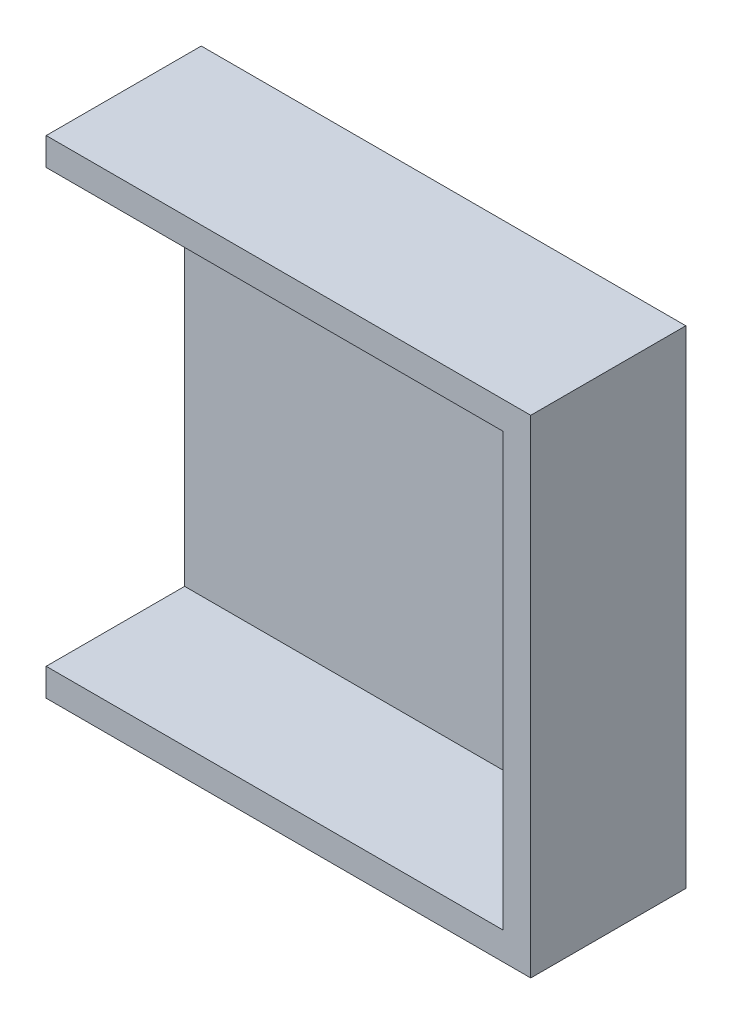
ISO-10303-21;
HEADER;
FILE_DESCRIPTION(('STEP AP214'),'2;1');
FILE_NAME('part.step','',(''),(''),'','','');
FILE_SCHEMA(('AUTOMOTIVE_DESIGN { 1 0 10303 214 1 1 1 1 }'));
ENDSEC;
DATA;
#1=APPLICATION_CONTEXT('core data for automotive mechanical design processes');
#2=APPLICATION_PROTOCOL_DEFINITION('international standard','automotive_design',2000,#1);
#3=PRODUCT_CONTEXT('',#1,'mechanical');
#4=PRODUCT('Part','Part','',(#3));
#5=PRODUCT_RELATED_PRODUCT_CATEGORY('part','',(#4));
#6=PRODUCT_DEFINITION_FORMATION('','',#4);
#7=PRODUCT_DEFINITION_CONTEXT('part definition',#1,'design');
#8=PRODUCT_DEFINITION('design','',#6,#7);
#9=PRODUCT_DEFINITION_SHAPE('','',#8);
#10=(LENGTH_UNIT() NAMED_UNIT(*) SI_UNIT(.MILLI.,.METRE.));
#11=(NAMED_UNIT(*) PLANE_ANGLE_UNIT() SI_UNIT($,.RADIAN.));
#12=(NAMED_UNIT(*) SI_UNIT($,.STERADIAN.) SOLID_ANGLE_UNIT());
#13=UNCERTAINTY_MEASURE_WITH_UNIT(LENGTH_MEASURE(1.E-05),#10,'distance_accuracy_value','');
#14=(GEOMETRIC_REPRESENTATION_CONTEXT(3) GLOBAL_UNCERTAINTY_ASSIGNED_CONTEXT((#13)) GLOBAL_UNIT_ASSIGNED_CONTEXT((#10,
#11,#12)) REPRESENTATION_CONTEXT('',''));
#15=CARTESIAN_POINT('',(0.,0.,0.));
#16=DIRECTION('',(0.,0.,1.));
#17=DIRECTION('',(1.,0.,0.));
#18=AXIS2_PLACEMENT_3D('',#15,#16,#17);
#19=CARTESIAN_POINT('',(-63.5908396946565,16.5526717557252,1.2));
#20=DIRECTION('',(1.,0.,0.));
#21=DIRECTION('',(0.,0.,-1.));
#22=AXIS2_PLACEMENT_3D('',#19,#20,#21);
#23=PLANE('',#22);
#24=DIRECTION('',(0.,-1.,0.));
#25=VECTOR('',#24,1.);
#26=CARTESIAN_POINT('',(-63.5908396946565,16.5526717557252,0.));
#27=LINE('',#26,#25);
#28=CARTESIAN_POINT('',(-63.5908396946565,16.5526717557252,0.));
#29=VERTEX_POINT('',#28);
#30=CARTESIAN_POINT('',(-63.5908396946565,-18.6473282442748,0.));
#31=VERTEX_POINT('',#30);
#32=EDGE_CURVE('E160',#29,#31,#27,.T.);
#33=ORIENTED_EDGE('',*,*,#32,.T.);
#34=DIRECTION('',(0.,0.,-1.));
#35=VECTOR('',#34,1.);
#36=CARTESIAN_POINT('',(-63.5908396946565,-18.6473282442748,1.2));
#37=LINE('',#36,#35);
#38=CARTESIAN_POINT('',(-63.5908396946565,-18.6473282442748,11.2));
#39=VERTEX_POINT('',#38);
#40=EDGE_CURVE('E11',#39,#31,#37,.T.);
#41=ORIENTED_EDGE('',*,*,#40,.F.);
#42=DIRECTION('',(0.,-1.,0.));
#43=VECTOR('',#42,1.);
#44=CARTESIAN_POINT('',(-63.5908396946565,-16.6473282442748,11.2));
#45=LINE('',#44,#43);
#46=CARTESIAN_POINT('',(-63.5908396946565,-16.6473282442748,11.2));
#47=VERTEX_POINT('',#46);
#48=EDGE_CURVE('E132',#47,#39,#45,.T.);
#49=ORIENTED_EDGE('',*,*,#48,.F.);
#50=DIRECTION('',(0.,0.,-1.));
#51=VECTOR('',#50,1.);
#52=CARTESIAN_POINT('',(-63.5908396946565,-16.6473282442748,11.2));
#53=LINE('',#52,#51);
#54=CARTESIAN_POINT('',(-63.5908396946565,-16.6473282442748,1.2));
#55=VERTEX_POINT('',#54);
#56=EDGE_CURVE('E138',#47,#55,#53,.T.);
#57=ORIENTED_EDGE('',*,*,#56,.T.);
#58=DIRECTION('',(0.,-1.,0.));
#59=VECTOR('',#58,1.);
#60=CARTESIAN_POINT('',(-63.5908396946565,16.5526717557252,1.2));
#61=LINE('',#60,#59);
#62=CARTESIAN_POINT('',(-63.5908396946565,14.5526717557252,1.2));
#63=VERTEX_POINT('',#62);
#64=EDGE_CURVE('E54',#63,#55,#61,.T.);
#65=ORIENTED_EDGE('',*,*,#64,.F.);
#66=DIRECTION('',(0.,0.,-1.));
#67=VECTOR('',#66,1.);
#68=CARTESIAN_POINT('',(-63.5908396946565,14.5526717557252,11.2));
#69=LINE('',#68,#67);
#70=CARTESIAN_POINT('',(-63.5908396946565,14.5526717557252,11.2));
#71=VERTEX_POINT('',#70);
#72=EDGE_CURVE('E113',#71,#63,#69,.T.);
#73=ORIENTED_EDGE('',*,*,#72,.F.);
#74=DIRECTION('',(0.,-1.,0.));
#75=VECTOR('',#74,1.);
#76=CARTESIAN_POINT('',(-63.5908396946565,16.5526717557252,11.2));
#77=LINE('',#76,#75);
#78=CARTESIAN_POINT('',(-63.5908396946565,16.5526717557252,11.2));
#79=VERTEX_POINT('',#78);
#80=EDGE_CURVE('E111',#79,#71,#77,.T.);
#81=ORIENTED_EDGE('',*,*,#80,.F.);
#82=DIRECTION('',(0.,0.,-1.));
#83=VECTOR('',#82,1.);
#84=CARTESIAN_POINT('',(-63.5908396946565,16.5526717557252,1.2));
#85=LINE('',#84,#83);
#86=EDGE_CURVE('E97',#79,#29,#85,.T.);
#87=ORIENTED_EDGE('',*,*,#86,.T.);
#88=EDGE_LOOP('',(#33,#41,#49,#57,#65,#73,#81,#87));
#89=FACE_BOUND('',#88,.T.);
#90=ADVANCED_FACE('F33',(#89),#23,.F.);
#91=CARTESIAN_POINT('',(-63.5908396946565,-18.6473282442748,1.2));
#92=DIRECTION('',(0.,1.,0.));
#93=DIRECTION('',(0.,0.,1.));
#94=AXIS2_PLACEMENT_3D('',#91,#92,#93);
#95=PLANE('',#94);
#96=DIRECTION('',(1.,0.,0.));
#97=VECTOR('',#96,1.);
#98=CARTESIAN_POINT('',(-63.5908396946565,-18.6473282442748,0.));
#99=LINE('',#98,#97);
#100=CARTESIAN_POINT('',(-28.5908396946565,-18.6473282442748,0.));
#101=VERTEX_POINT('',#100);
#102=EDGE_CURVE('E180',#31,#101,#99,.T.);
#103=ORIENTED_EDGE('',*,*,#102,.T.);
#104=DIRECTION('',(0.,0.,-1.));
#105=VECTOR('',#104,1.);
#106=CARTESIAN_POINT('',(-28.5908396946565,-18.6473282442748,1.2));
#107=LINE('',#106,#105);
#108=CARTESIAN_POINT('',(-28.5908396946565,-18.6473282442748,11.2));
#109=VERTEX_POINT('',#108);
#110=EDGE_CURVE('E41',#109,#101,#107,.T.);
#111=ORIENTED_EDGE('',*,*,#110,.F.);
#112=DIRECTION('',(1.,0.,0.));
#113=VECTOR('',#112,1.);
#114=CARTESIAN_POINT('',(-63.5908396946565,-18.6473282442748,11.2));
#115=LINE('',#114,#113);
#116=EDGE_CURVE('E135',#39,#109,#115,.T.);
#117=ORIENTED_EDGE('',*,*,#116,.F.);
#118=ORIENTED_EDGE('',*,*,#40,.T.);
#119=EDGE_LOOP('',(#103,#111,#117,#118));
#120=FACE_BOUND('',#119,.T.);
#121=ADVANCED_FACE('F178',(#120),#95,.F.);
#122=CARTESIAN_POINT('',(-28.5908396946565,16.5526717557252,1.2));
#123=DIRECTION('',(-1.,0.,0.));
#124=DIRECTION('',(0.,-1.,0.));
#125=AXIS2_PLACEMENT_3D('',#122,#123,#124);
#126=PLANE('',#125);
#127=DIRECTION('',(0.,1.,0.));
#128=VECTOR('',#127,1.);
#129=CARTESIAN_POINT('',(-28.5908396946565,16.5526717557252,0.));
#130=LINE('',#129,#128);
#131=CARTESIAN_POINT('',(-28.5908396946565,16.5526717557252,0.));
#132=VERTEX_POINT('',#131);
#133=EDGE_CURVE('E186',#101,#132,#130,.T.);
#134=ORIENTED_EDGE('',*,*,#133,.T.);
#135=DIRECTION('',(0.,0.,-1.));
#136=VECTOR('',#135,1.);
#137=CARTESIAN_POINT('',(-28.5908396946565,16.5526717557252,1.2));
#138=LINE('',#137,#136);
#139=CARTESIAN_POINT('',(-28.5908396946565,16.5526717557252,11.2));
#140=VERTEX_POINT('',#139);
#141=EDGE_CURVE('E108',#140,#132,#138,.T.);
#142=ORIENTED_EDGE('',*,*,#141,.F.);
#143=DIRECTION('',(0.,1.,0.));
#144=VECTOR('',#143,1.);
#145=CARTESIAN_POINT('',(-28.5908396946565,-18.6473282442748,11.2));
#146=LINE('',#145,#144);
#147=EDGE_CURVE('E122',#109,#140,#146,.T.);
#148=ORIENTED_EDGE('',*,*,#147,.F.);
#149=ORIENTED_EDGE('',*,*,#110,.T.);
#150=EDGE_LOOP('',(#134,#142,#148,#149));
#151=FACE_BOUND('',#150,.T.);
#152=ADVANCED_FACE('F189',(#151),#126,.F.);
#153=CARTESIAN_POINT('',(-63.5908396946565,16.5526717557252,1.2));
#154=DIRECTION('',(0.,-1.,0.));
#155=DIRECTION('',(0.,0.,-1.));
#156=AXIS2_PLACEMENT_3D('',#153,#154,#155);
#157=PLANE('',#156);
#158=DIRECTION('',(-1.,0.,0.));
#159=VECTOR('',#158,1.);
#160=CARTESIAN_POINT('',(-63.5908396946565,16.5526717557252,0.));
#161=LINE('',#160,#159);
#162=EDGE_CURVE('E104',#132,#29,#161,.T.);
#163=ORIENTED_EDGE('',*,*,#162,.T.);
#164=ORIENTED_EDGE('',*,*,#86,.F.);
#165=DIRECTION('',(-1.,0.,0.));
#166=VECTOR('',#165,1.);
#167=CARTESIAN_POINT('',(-28.5908396946565,16.5526717557252,11.2));
#168=LINE('',#167,#166);
#169=EDGE_CURVE('E102',#140,#79,#168,.T.);
#170=ORIENTED_EDGE('',*,*,#169,.F.);
#171=ORIENTED_EDGE('',*,*,#141,.T.);
#172=EDGE_LOOP('',(#163,#164,#170,#171));
#173=FACE_BOUND('',#172,.T.);
#174=ADVANCED_FACE('F99',(#173),#157,.F.);
#175=CARTESIAN_POINT('',(0.,0.,1.2));
#176=DIRECTION('',(0.,0.,1.));
#177=DIRECTION('',(1.,0.,0.));
#178=AXIS2_PLACEMENT_3D('',#175,#176,#177);
#179=PLANE('',#178);
#180=DIRECTION('',(-1.,0.,0.));
#181=VECTOR('',#180,1.);
#182=CARTESIAN_POINT('',(-30.5908396946565,-16.6473282442748,1.2));
#183=LINE('',#182,#181);
#184=CARTESIAN_POINT('',(-30.5908396946565,-16.6473282442748,1.2));
#185=VERTEX_POINT('',#184);
#186=EDGE_CURVE('E49',#185,#55,#183,.T.);
#187=ORIENTED_EDGE('',*,*,#186,.F.);
#188=DIRECTION('',(0.,-1.,0.));
#189=VECTOR('',#188,1.);
#190=CARTESIAN_POINT('',(-30.5908396946565,14.5526717557252,1.2));
#191=LINE('',#190,#189);
#192=CARTESIAN_POINT('',(-30.5908396946565,14.5526717557252,1.2));
#193=VERTEX_POINT('',#192);
#194=EDGE_CURVE('E124',#193,#185,#191,.T.);
#195=ORIENTED_EDGE('',*,*,#194,.F.);
#196=DIRECTION('',(1.,0.,0.));
#197=VECTOR('',#196,1.);
#198=CARTESIAN_POINT('',(-63.5908396946565,14.5526717557252,1.2));
#199=LINE('',#198,#197);
#200=EDGE_CURVE('E140',#63,#193,#199,.T.);
#201=ORIENTED_EDGE('',*,*,#200,.F.);
#202=ORIENTED_EDGE('',*,*,#64,.T.);
#203=EDGE_LOOP('',(#187,#195,#201,#202));
#204=FACE_BOUND('',#203,.T.);
#205=ADVANCED_FACE('F173',(#204),#179,.T.);
#206=CARTESIAN_POINT('',(0.,0.,0.));
#207=DIRECTION('',(0.,0.,1.));
#208=DIRECTION('',(1.,0.,0.));
#209=AXIS2_PLACEMENT_3D('',#206,#207,#208);
#210=PLANE('',#209);
#211=ORIENTED_EDGE('',*,*,#32,.F.);
#212=ORIENTED_EDGE('',*,*,#162,.F.);
#213=ORIENTED_EDGE('',*,*,#133,.F.);
#214=ORIENTED_EDGE('',*,*,#102,.F.);
#215=EDGE_LOOP('',(#211,#212,#213,#214));
#216=FACE_BOUND('',#215,.T.);
#217=ADVANCED_FACE('F188',(#216),#210,.F.);
#218=CARTESIAN_POINT('',(-63.5908396946565,14.5526717557252,11.2));
#219=DIRECTION('',(0.,1.,0.));
#220=DIRECTION('',(0.,0.,1.));
#221=AXIS2_PLACEMENT_3D('',#218,#219,#220);
#222=PLANE('',#221);
#223=ORIENTED_EDGE('',*,*,#200,.T.);
#224=DIRECTION('',(0.,0.,-1.));
#225=VECTOR('',#224,1.);
#226=CARTESIAN_POINT('',(-30.5908396946565,14.5526717557252,11.2));
#227=LINE('',#226,#225);
#228=CARTESIAN_POINT('',(-30.5908396946565,14.5526717557252,11.2));
#229=VERTEX_POINT('',#228);
#230=EDGE_CURVE('E152',#229,#193,#227,.T.);
#231=ORIENTED_EDGE('',*,*,#230,.F.);
#232=DIRECTION('',(1.,0.,0.));
#233=VECTOR('',#232,1.);
#234=CARTESIAN_POINT('',(-63.5908396946565,14.5526717557252,11.2));
#235=LINE('',#234,#233);
#236=EDGE_CURVE('E116',#71,#229,#235,.T.);
#237=ORIENTED_EDGE('',*,*,#236,.F.);
#238=ORIENTED_EDGE('',*,*,#72,.T.);
#239=EDGE_LOOP('',(#223,#231,#237,#238));
#240=FACE_BOUND('',#239,.T.);
#241=ADVANCED_FACE('F172',(#240),#222,.F.);
#242=CARTESIAN_POINT('',(-30.5908396946565,14.5526717557252,11.2));
#243=DIRECTION('',(1.,0.,0.));
#244=DIRECTION('',(0.,1.,0.));
#245=AXIS2_PLACEMENT_3D('',#242,#243,#244);
#246=PLANE('',#245);
#247=ORIENTED_EDGE('',*,*,#194,.T.);
#248=DIRECTION('',(0.,0.,-1.));
#249=VECTOR('',#248,1.);
#250=CARTESIAN_POINT('',(-30.5908396946565,-16.6473282442748,11.2));
#251=LINE('',#250,#249);
#252=CARTESIAN_POINT('',(-30.5908396946565,-16.6473282442748,11.2));
#253=VERTEX_POINT('',#252);
#254=EDGE_CURVE('E143',#253,#185,#251,.T.);
#255=ORIENTED_EDGE('',*,*,#254,.F.);
#256=DIRECTION('',(0.,-1.,0.));
#257=VECTOR('',#256,1.);
#258=CARTESIAN_POINT('',(-30.5908396946565,14.5526717557252,11.2));
#259=LINE('',#258,#257);
#260=EDGE_CURVE('E128',#229,#253,#259,.T.);
#261=ORIENTED_EDGE('',*,*,#260,.F.);
#262=ORIENTED_EDGE('',*,*,#230,.T.);
#263=EDGE_LOOP('',(#247,#255,#261,#262));
#264=FACE_BOUND('',#263,.T.);
#265=ADVANCED_FACE('F174',(#264),#246,.F.);
#266=CARTESIAN_POINT('',(-30.5908396946565,-16.6473282442748,11.2));
#267=DIRECTION('',(0.,-1.,0.));
#268=DIRECTION('',(0.,0.,-1.));
#269=AXIS2_PLACEMENT_3D('',#266,#267,#268);
#270=PLANE('',#269);
#271=ORIENTED_EDGE('',*,*,#186,.T.);
#272=ORIENTED_EDGE('',*,*,#56,.F.);
#273=DIRECTION('',(-1.,0.,0.));
#274=VECTOR('',#273,1.);
#275=CARTESIAN_POINT('',(-30.5908396946565,-16.6473282442748,11.2));
#276=LINE('',#275,#274);
#277=EDGE_CURVE('E130',#253,#47,#276,.T.);
#278=ORIENTED_EDGE('',*,*,#277,.F.);
#279=ORIENTED_EDGE('',*,*,#254,.T.);
#280=EDGE_LOOP('',(#271,#272,#278,#279));
#281=FACE_BOUND('',#280,.T.);
#282=ADVANCED_FACE('F175',(#281),#270,.F.);
#283=CARTESIAN_POINT('',(0.,0.,11.2));
#284=DIRECTION('',(0.,0.,1.));
#285=DIRECTION('',(1.,0.,0.));
#286=AXIS2_PLACEMENT_3D('',#283,#284,#285);
#287=PLANE('',#286);
#288=ORIENTED_EDGE('',*,*,#169,.T.);
#289=ORIENTED_EDGE('',*,*,#80,.T.);
#290=ORIENTED_EDGE('',*,*,#236,.T.);
#291=ORIENTED_EDGE('',*,*,#260,.T.);
#292=ORIENTED_EDGE('',*,*,#277,.T.);
#293=ORIENTED_EDGE('',*,*,#48,.T.);
#294=ORIENTED_EDGE('',*,*,#116,.T.);
#295=ORIENTED_EDGE('',*,*,#147,.T.);
#296=EDGE_LOOP('',(#288,#289,#290,#291,#292,#293,#294,#295));
#297=FACE_BOUND('',#296,.T.);
#298=ADVANCED_FACE('F119',(#297),#287,.T.);
#299=CLOSED_SHELL('',(#90,#121,#152,#174,#205,#217,#241,#265,#282,#298));
#300=MANIFOLD_SOLID_BREP('B2',#299);
#301=ADVANCED_BREP_SHAPE_REPRESENTATION('',(#18,#300),#14);
#302=SHAPE_DEFINITION_REPRESENTATION(#9,#301);
ENDSEC;
END-ISO-10303-21;
